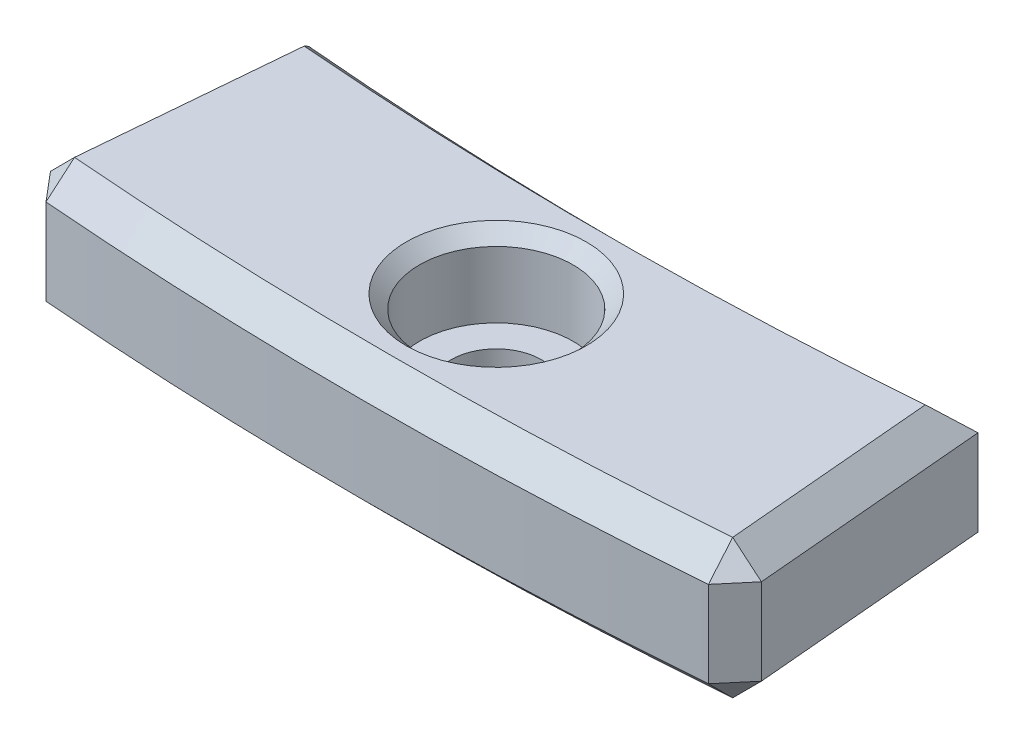
ISO-10303-21;
HEADER;
FILE_DESCRIPTION(('STEP AP214'),'2;1');
FILE_NAME('part.step','',(''),(''),'','','');
FILE_SCHEMA(('AUTOMOTIVE_DESIGN { 1 0 10303 214 1 1 1 1 }'));
ENDSEC;
DATA;
#1=APPLICATION_CONTEXT('core data for automotive mechanical design processes');
#2=APPLICATION_PROTOCOL_DEFINITION('international standard','automotive_design',2000,#1);
#3=PRODUCT_CONTEXT('',#1,'mechanical');
#4=PRODUCT('Part','Part','',(#3));
#5=PRODUCT_RELATED_PRODUCT_CATEGORY('part','',(#4));
#6=PRODUCT_DEFINITION_FORMATION('','',#4);
#7=PRODUCT_DEFINITION_CONTEXT('part definition',#1,'design');
#8=PRODUCT_DEFINITION('design','',#6,#7);
#9=PRODUCT_DEFINITION_SHAPE('','',#8);
#10=(LENGTH_UNIT() NAMED_UNIT(*) SI_UNIT(.MILLI.,.METRE.));
#11=(NAMED_UNIT(*) PLANE_ANGLE_UNIT() SI_UNIT($,.RADIAN.));
#12=(NAMED_UNIT(*) SI_UNIT($,.STERADIAN.) SOLID_ANGLE_UNIT());
#13=UNCERTAINTY_MEASURE_WITH_UNIT(LENGTH_MEASURE(1.E-05),#10,'distance_accuracy_value','');
#14=(GEOMETRIC_REPRESENTATION_CONTEXT(3) GLOBAL_UNCERTAINTY_ASSIGNED_CONTEXT((#13)) GLOBAL_UNIT_ASSIGNED_CONTEXT((#10,
#11,#12)) REPRESENTATION_CONTEXT('',''));
#15=CARTESIAN_POINT('',(0.,0.,0.));
#16=DIRECTION('',(0.,0.,1.));
#17=DIRECTION('',(1.,0.,0.));
#18=AXIS2_PLACEMENT_3D('',#15,#16,#17);
#19=CARTESIAN_POINT('',(0.,5.25,150.));
#20=DIRECTION('',(0.,-1.,0.));
#21=DIRECTION('',(0.,0.,-1.));
#22=AXIS2_PLACEMENT_3D('',#19,#20,#21);
#23=CYLINDRICAL_SURFACE('',#22,1.7);
#24=CARTESIAN_POINT('',(0.,0.,150.));
#25=DIRECTION('',(0.,1.,0.));
#26=DIRECTION('',(0.,0.,1.));
#27=AXIS2_PLACEMENT_3D('',#24,#25,#26);
#28=CIRCLE('',#27,1.7);
#29=CARTESIAN_POINT('',(0.,0.,148.3));
#30=VERTEX_POINT('',#29);
#31=EDGE_CURVE('E394',#30,#30,#28,.T.);
#32=CARTESIAN_POINT('',(0.,2.25,150.));
#33=DIRECTION('',(0.,1.,0.));
#34=DIRECTION('',(0.,0.,1.));
#35=AXIS2_PLACEMENT_3D('',#32,#33,#34);
#36=CIRCLE('',#35,1.7);
#37=CARTESIAN_POINT('',(0.,2.25,148.3));
#38=VERTEX_POINT('',#37);
#39=EDGE_CURVE('E391',#38,#38,#36,.T.);
#40=CARTESIAN_POINT('',(0.,0.,148.3));
#41=CARTESIAN_POINT('',(0.,0.0234375,148.3));
#42=CARTESIAN_POINT('',(0.,0.046875,148.3));
#43=CARTESIAN_POINT('',(0.,0.0937500000000001,148.3));
#44=CARTESIAN_POINT('',(0.,0.1171875,148.3));
#45=CARTESIAN_POINT('',(0.,0.1640625,148.3));
#46=CARTESIAN_POINT('',(0.,0.1875,148.3));
#47=CARTESIAN_POINT('',(0.,0.234375,148.3));
#48=CARTESIAN_POINT('',(0.,0.2578125,148.3));
#49=CARTESIAN_POINT('',(0.,0.3046875,148.3));
#50=CARTESIAN_POINT('',(0.,0.328125,148.3));
#51=CARTESIAN_POINT('',(0.,0.375,148.3));
#52=CARTESIAN_POINT('',(0.,0.3984375,148.3));
#53=CARTESIAN_POINT('',(0.,0.4453125,148.3));
#54=CARTESIAN_POINT('',(0.,0.46875,148.3));
#55=CARTESIAN_POINT('',(0.,0.515625,148.3));
#56=CARTESIAN_POINT('',(0.,0.5390625,148.3));
#57=CARTESIAN_POINT('',(0.,0.5859375,148.3));
#58=CARTESIAN_POINT('',(0.,0.609375,148.3));
#59=CARTESIAN_POINT('',(0.,0.65625,148.3));
#60=CARTESIAN_POINT('',(0.,0.6796875,148.3));
#61=CARTESIAN_POINT('',(0.,0.7265625,148.3));
#62=CARTESIAN_POINT('',(0.,0.75,148.3));
#63=CARTESIAN_POINT('',(0.,0.796875,148.3));
#64=CARTESIAN_POINT('',(0.,0.8203125,148.3));
#65=CARTESIAN_POINT('',(0.,0.8671875,148.3));
#66=CARTESIAN_POINT('',(0.,0.890625,148.3));
#67=CARTESIAN_POINT('',(0.,0.9375,148.3));
#68=CARTESIAN_POINT('',(0.,0.9609375,148.3));
#69=CARTESIAN_POINT('',(0.,1.0078125,148.3));
#70=CARTESIAN_POINT('',(0.,1.03125,148.3));
#71=CARTESIAN_POINT('',(0.,1.078125,148.3));
#72=CARTESIAN_POINT('',(0.,1.1015625,148.3));
#73=CARTESIAN_POINT('',(0.,1.1484375,148.3));
#74=CARTESIAN_POINT('',(0.,1.171875,148.3));
#75=CARTESIAN_POINT('',(0.,1.21875,148.3));
#76=CARTESIAN_POINT('',(0.,1.2421875,148.3));
#77=CARTESIAN_POINT('',(0.,1.2890625,148.3));
#78=CARTESIAN_POINT('',(0.,1.3125,148.3));
#79=CARTESIAN_POINT('',(0.,1.359375,148.3));
#80=CARTESIAN_POINT('',(0.,1.3828125,148.3));
#81=CARTESIAN_POINT('',(0.,1.4296875,148.3));
#82=CARTESIAN_POINT('',(0.,1.453125,148.3));
#83=CARTESIAN_POINT('',(0.,1.5,148.3));
#84=CARTESIAN_POINT('',(0.,1.5234375,148.3));
#85=CARTESIAN_POINT('',(0.,1.5703125,148.3));
#86=CARTESIAN_POINT('',(0.,1.59375,148.3));
#87=CARTESIAN_POINT('',(0.,1.640625,148.3));
#88=CARTESIAN_POINT('',(0.,1.6640625,148.3));
#89=CARTESIAN_POINT('',(0.,1.7109375,148.3));
#90=CARTESIAN_POINT('',(0.,1.734375,148.3));
#91=CARTESIAN_POINT('',(0.,1.78125,148.3));
#92=CARTESIAN_POINT('',(0.,1.8046875,148.3));
#93=CARTESIAN_POINT('',(0.,1.8515625,148.3));
#94=CARTESIAN_POINT('',(0.,1.875,148.3));
#95=CARTESIAN_POINT('',(0.,1.921875,148.3));
#96=CARTESIAN_POINT('',(0.,1.9453125,148.3));
#97=CARTESIAN_POINT('',(0.,1.9921875,148.3));
#98=CARTESIAN_POINT('',(0.,2.015625,148.3));
#99=CARTESIAN_POINT('',(0.,2.0625,148.3));
#100=CARTESIAN_POINT('',(0.,2.0859375,148.3));
#101=CARTESIAN_POINT('',(0.,2.1328125,148.3));
#102=CARTESIAN_POINT('',(0.,2.15625,148.3));
#103=CARTESIAN_POINT('',(0.,2.203125,148.3));
#104=CARTESIAN_POINT('',(0.,2.2265625,148.3));
#105=CARTESIAN_POINT('',(0.,2.25,148.3));
#106=B_SPLINE_CURVE_WITH_KNOTS('',3,(#40,#41,#42,#43,#44,#45,#46,#47,#48,#49,#50,#51,#52,#53,
#54,#55,#56,#57,#58,#59,#60,#61,#62,#63,#64,#65,#66,#67,#68,#69,#70,#71,#72,#73,#74,#75,#76,#77,
#78,#79,#80,#81,#82,#83,#84,#85,#86,#87,#88,#89,#90,#91,#92,#93,#94,#95,#96,#97,#98,#99,#100,
#101,#102,#103,#104,#105),.UNSPECIFIED.,.F.,.F.,(4,2,2,2,2,2,2,2,2,2,2,2,2,2,2,2,2,2,2,2,2,2,2,
2,2,2,2,2,2,2,2,2,4),(0.,0.0703125000000001,0.140625,0.2109375,0.28125,0.3515625,0.421875,
0.4921875,0.5625,0.6328125,0.703125,0.7734375,0.84375,0.9140625,0.984375,1.0546875,1.125,
1.1953125,1.265625,1.3359375,1.40625,1.4765625,1.546875,1.6171875,1.6875,1.7578125,1.828125,
1.8984375,1.96875,2.0390625,2.109375,2.1796875,2.25),.UNSPECIFIED.);
#107=EDGE_CURVE('BSEAM32',#30,#38,#106,.T.);
#108=ORIENTED_EDGE('',*,*,#31,.F.);
#109=ORIENTED_EDGE('',*,*,#39,.T.);
#110=ORIENTED_EDGE('',*,*,#107,.T.);
#111=ORIENTED_EDGE('',*,*,#107,.F.);
#112=EDGE_LOOP('',(#108,#110,#109,#111));
#113=FACE_BOUND('',#112,.T.);
#114=ADVANCED_FACE('F32',(#113),#23,.F.);
#115=CARTESIAN_POINT('',(0.,5.25,0.));
#116=DIRECTION('',(0.,1.,0.));
#117=DIRECTION('',(0.,0.,1.));
#118=AXIS2_PLACEMENT_3D('',#115,#116,#117);
#119=PLANE('',#118);
#120=DIRECTION('',(-0.0871557427476587,0.,0.996194698091746));
#121=VECTOR('',#120,1.);
#122=CARTESIAN_POINT('',(-12.5129454277953,5.25,154.497333946968));
#123=LINE('',#122,#121);
#124=CARTESIAN_POINT('',(-11.7282452609946,5.25,145.528169998451));
#125=VERTEX_POINT('',#124);
#126=CARTESIAN_POINT('',(-12.4255067088739,5.25,153.49790481641));
#127=VERTEX_POINT('',#126);
#128=EDGE_CURVE('E62',#125,#127,#123,.T.);
#129=ORIENTED_EDGE('',*,*,#128,.T.);
#130=CARTESIAN_POINT('',(0.,5.25,0.));
#131=DIRECTION('',(0.,1.,0.));
#132=DIRECTION('',(0.,0.,1.));
#133=AXIS2_PLACEMENT_3D('',#130,#131,#132);
#134=CIRCLE('',#133,154.);
#135=CARTESIAN_POINT('',(12.4255067088739,5.25,153.49790481641));
#136=VERTEX_POINT('',#135);
#137=EDGE_CURVE('E11',#127,#136,#134,.T.);
#138=ORIENTED_EDGE('',*,*,#137,.T.);
#139=DIRECTION('',(-0.0871557427476587,0.,-0.996194698091746));
#140=VECTOR('',#139,1.);
#141=CARTESIAN_POINT('',(11.6413880003187,5.25,144.535386966051));
#142=LINE('',#141,#140);
#143=CARTESIAN_POINT('',(11.7282452609946,5.25,145.528169998451));
#144=VERTEX_POINT('',#143);
#145=EDGE_CURVE('E47',#136,#144,#142,.T.);
#146=ORIENTED_EDGE('',*,*,#145,.T.);
#147=CARTESIAN_POINT('',(0.,5.25,0.));
#148=DIRECTION('',(0.,1.,0.));
#149=DIRECTION('',(0.,0.,1.));
#150=AXIS2_PLACEMENT_3D('',#147,#148,#149);
#151=CIRCLE('',#150,146.);
#152=EDGE_CURVE('E430',#144,#125,#151,.F.);
#153=ORIENTED_EDGE('',*,*,#152,.T.);
#154=EDGE_LOOP('',(#129,#138,#146,#153));
#155=FACE_BOUND('',#154,.T.);
#156=CARTESIAN_POINT('',(0.,5.25,150.));
#157=DIRECTION('',(0.,1.,0.));
#158=DIRECTION('',(0.,0.,1.));
#159=AXIS2_PLACEMENT_3D('',#156,#157,#158);
#160=CIRCLE('',#159,3.40000000000001);
#161=CARTESIAN_POINT('',(0.,5.25,153.4));
#162=VERTEX_POINT('',#161);
#163=EDGE_CURVE('E130',#162,#162,#160,.F.);
#164=ORIENTED_EDGE('',*,*,#163,.T.);
#165=EDGE_LOOP('',(#164));
#166=FACE_BOUND('',#165,.T.);
#167=ADVANCED_FACE('F178',(#155,#166),#119,.T.);
#168=CARTESIAN_POINT('',(0.,0.,0.));
#169=DIRECTION('',(0.,1.,0.));
#170=DIRECTION('',(0.,0.,1.));
#171=AXIS2_PLACEMENT_3D('',#168,#169,#170);
#172=PLANE('',#171);
#173=CARTESIAN_POINT('',(0.,0.,0.));
#174=DIRECTION('',(0.,1.,0.));
#175=DIRECTION('',(0.,0.,1.));
#176=AXIS2_PLACEMENT_3D('',#173,#174,#175);
#177=CIRCLE('',#176,154.);
#178=CARTESIAN_POINT('',(12.4255067088739,0.,153.49790481641));
#179=VERTEX_POINT('',#178);
#180=CARTESIAN_POINT('',(-12.4255067088739,0.,153.49790481641));
#181=VERTEX_POINT('',#180);
#182=EDGE_CURVE('E410',#179,#181,#177,.F.);
#183=ORIENTED_EDGE('',*,*,#182,.T.);
#184=DIRECTION('',(0.0871557427476587,0.,-0.996194698091746));
#185=VECTOR('',#184,1.);
#186=CARTESIAN_POINT('',(0.996194698091842,0.,0.0871557427476671));
#187=LINE('',#186,#185);
#188=CARTESIAN_POINT('',(-11.6410874597011,0.,144.531951771072));
#189=VERTEX_POINT('',#188);
#190=EDGE_CURVE('E152',#181,#189,#187,.T.);
#191=ORIENTED_EDGE('',*,*,#190,.T.);
#192=CARTESIAN_POINT('',(0.,0.,0.));
#193=DIRECTION('',(0.,-1.,0.));
#194=DIRECTION('',(0.,0.,1.));
#195=AXIS2_PLACEMENT_3D('',#192,#193,#194);
#196=CIRCLE('',#195,145.);
#197=CARTESIAN_POINT('',(11.6410874597011,0.,144.531951771072));
#198=VERTEX_POINT('',#197);
#199=EDGE_CURVE('E399',#198,#189,#196,.T.);
#200=ORIENTED_EDGE('',*,*,#199,.F.);
#201=DIRECTION('',(0.0871557427476587,0.,0.996194698091746));
#202=VECTOR('',#201,1.);
#203=CARTESIAN_POINT('',(-0.996194698091842,0.,0.0871557427476671));
#204=LINE('',#203,#202);
#205=EDGE_CURVE('E408',#198,#179,#204,.T.);
#206=ORIENTED_EDGE('',*,*,#205,.T.);
#207=EDGE_LOOP('',(#183,#191,#200,#206));
#208=FACE_BOUND('',#207,.T.);
#209=ORIENTED_EDGE('',*,*,#31,.T.);
#210=EDGE_LOOP('',(#209));
#211=FACE_BOUND('',#210,.T.);
#212=ADVANCED_FACE('F184',(#208,#211),#172,.F.);
#213=CARTESIAN_POINT('',(0.,5.25,0.));
#214=DIRECTION('',(0.,-1.,0.));
#215=DIRECTION('',(0.,0.,-1.));
#216=AXIS2_PLACEMENT_3D('',#213,#214,#215);
#217=CYLINDRICAL_SURFACE('',#216,145.);
#218=ORIENTED_EDGE('',*,*,#199,.T.);
#219=CARTESIAN_POINT('',(0.,1.00000000000007,0.));
#220=DIRECTION('',(0.704416026402749,0.707106781186557,0.0616284167162189));
#221=DIRECTION('',(0.704416026402768,-0.707106781186538,0.0616284167162206));
#222=AXIS2_PLACEMENT_3D('',#219,#220,#221);
#223=ELLIPSE('',#222,205.060966544096,145.);
#224=CARTESIAN_POINT('',(-12.6375826984104,1.,144.448231223303));
#225=VERTEX_POINT('',#224);
#226=EDGE_CURVE('E140',#189,#225,#223,.F.);
#227=ORIENTED_EDGE('',*,*,#226,.T.);
#228=DIRECTION('',(0.,-1.,0.));
#229=VECTOR('',#228,1.);
#230=CARTESIAN_POINT('',(-12.6375826984104,5.25,144.448231223303));
#231=LINE('',#230,#229);
#232=CARTESIAN_POINT('',(-12.6375826984104,4.24999999999998,144.448231223303));
#233=VERTEX_POINT('',#232);
#234=EDGE_CURVE('E122',#233,#225,#231,.T.);
#235=ORIENTED_EDGE('',*,*,#234,.F.);
#236=CARTESIAN_POINT('',(0.,4.24999999999998,0.));
#237=DIRECTION('',(0.,1.,0.));
#238=DIRECTION('',(0.,0.,1.));
#239=AXIS2_PLACEMENT_3D('',#236,#237,#238);
#240=CIRCLE('',#239,145.);
#241=CARTESIAN_POINT('',(12.6375826984104,4.24999999999998,144.448231223303));
#242=VERTEX_POINT('',#241);
#243=EDGE_CURVE('E137',#233,#242,#240,.T.);
#244=ORIENTED_EDGE('',*,*,#243,.T.);
#245=DIRECTION('',(0.,-1.,0.));
#246=VECTOR('',#245,1.);
#247=CARTESIAN_POINT('',(12.6375826984104,5.25,144.448231223303));
#248=LINE('',#247,#246);
#249=CARTESIAN_POINT('',(12.6375826984104,1.,144.448231223303));
#250=VERTEX_POINT('',#249);
#251=EDGE_CURVE('E142',#242,#250,#248,.T.);
#252=ORIENTED_EDGE('',*,*,#251,.T.);
#253=CARTESIAN_POINT('',(0.,1.00000000000007,0.));
#254=DIRECTION('',(-0.704416026402749,0.707106781186557,0.0616284167162189));
#255=DIRECTION('',(-0.704416026402768,-0.707106781186538,0.0616284167162206));
#256=AXIS2_PLACEMENT_3D('',#253,#254,#255);
#257=ELLIPSE('',#256,205.060966544096,145.);
#258=EDGE_CURVE('E151',#250,#198,#257,.F.);
#259=ORIENTED_EDGE('',*,*,#258,.T.);
#260=EDGE_LOOP('',(#218,#227,#235,#244,#252,#259));
#261=FACE_BOUND('',#260,.T.);
#262=ADVANCED_FACE('F135',(#261),#217,.F.);
#263=CARTESIAN_POINT('',(-13.509140125887,5.25,154.410178204221));
#264=DIRECTION('',(0.996194698091746,0.,0.0871557427476587));
#265=DIRECTION('',(0.0871557427476587,0.,-0.996194698091745));
#266=AXIS2_PLACEMENT_3D('',#263,#264,#265);
#267=PLANE('',#266);
#268=ORIENTED_EDGE('',*,*,#234,.T.);
#269=DIRECTION('',(-0.0871557427476587,0.,0.996194698091745));
#270=VECTOR('',#269,1.);
#271=CARTESIAN_POINT('',(-13.509140125887,1.,154.410178204221));
#272=LINE('',#271,#270);
#273=CARTESIAN_POINT('',(-13.4217014069656,1.,153.410749073663));
#274=VERTEX_POINT('',#273);
#275=EDGE_CURVE('E406',#225,#274,#272,.T.);
#276=ORIENTED_EDGE('',*,*,#275,.T.);
#277=DIRECTION('',(0.,1.,0.));
#278=VECTOR('',#277,1.);
#279=CARTESIAN_POINT('',(-13.4217014069656,5.25,153.410749073663));
#280=LINE('',#279,#278);
#281=CARTESIAN_POINT('',(-13.4217014069656,4.24999999999998,153.410749073663));
#282=VERTEX_POINT('',#281);
#283=EDGE_CURVE('E125',#274,#282,#280,.T.);
#284=ORIENTED_EDGE('',*,*,#283,.T.);
#285=DIRECTION('',(0.0871557427476587,0.,-0.996194698091745));
#286=VECTOR('',#285,1.);
#287=CARTESIAN_POINT('',(-12.6375826984104,4.24999999999998,144.448231223303));
#288=LINE('',#287,#286);
#289=EDGE_CURVE('E118',#282,#233,#288,.T.);
#290=ORIENTED_EDGE('',*,*,#289,.T.);
#291=EDGE_LOOP('',(#268,#276,#284,#290));
#292=FACE_BOUND('',#291,.T.);
#293=ADVANCED_FACE('F120',(#292),#267,.F.);
#294=CARTESIAN_POINT('',(0.,5.25,0.));
#295=DIRECTION('',(0.,-1.,0.));
#296=DIRECTION('',(0.,0.,-1.));
#297=AXIS2_PLACEMENT_3D('',#294,#295,#296);
#298=CYLINDRICAL_SURFACE('',#297,155.);
#299=DIRECTION('',(0.,-1.,0.));
#300=VECTOR('',#299,1.);
#301=CARTESIAN_POINT('',(-12.5061918173731,5.25,154.494644458075));
#302=LINE('',#301,#300);
#303=CARTESIAN_POINT('',(-12.5061918173731,4.24999999999998,154.494644458075));
#304=VERTEX_POINT('',#303);
#305=CARTESIAN_POINT('',(-12.5061918173731,1.,154.494644458075));
#306=VERTEX_POINT('',#305);
#307=EDGE_CURVE('E417',#304,#306,#302,.T.);
#308=ORIENTED_EDGE('',*,*,#307,.T.);
#309=CARTESIAN_POINT('',(0.,1.,0.));
#310=DIRECTION('',(0.,1.,0.));
#311=DIRECTION('',(0.,0.,1.));
#312=AXIS2_PLACEMENT_3D('',#309,#310,#311);
#313=CIRCLE('',#312,155.);
#314=CARTESIAN_POINT('',(12.506191817373,1.,154.494644458075));
#315=VERTEX_POINT('',#314);
#316=EDGE_CURVE('E421',#306,#315,#313,.T.);
#317=ORIENTED_EDGE('',*,*,#316,.T.);
#318=DIRECTION('',(0.,-1.,0.));
#319=VECTOR('',#318,1.);
#320=CARTESIAN_POINT('',(12.506191817373,5.25,154.494644458075));
#321=LINE('',#320,#319);
#322=CARTESIAN_POINT('',(12.506191817373,4.24999999999998,154.494644458075));
#323=VERTEX_POINT('',#322);
#324=EDGE_CURVE('E419',#315,#323,#321,.F.);
#325=ORIENTED_EDGE('',*,*,#324,.T.);
#326=CARTESIAN_POINT('',(0.,4.24999999999998,0.));
#327=DIRECTION('',(0.,1.,0.));
#328=DIRECTION('',(0.,0.,1.));
#329=AXIS2_PLACEMENT_3D('',#326,#327,#328);
#330=CIRCLE('',#329,155.);
#331=EDGE_CURVE('E415',#323,#304,#330,.F.);
#332=ORIENTED_EDGE('',*,*,#331,.T.);
#333=EDGE_LOOP('',(#308,#317,#325,#332));
#334=FACE_BOUND('',#333,.T.);
#335=ADVANCED_FACE('F198',(#334),#298,.T.);
#336=CARTESIAN_POINT('',(13.509140125887,5.25,154.410178204221));
#337=DIRECTION('',(-0.996194698091746,0.,0.0871557427476587));
#338=DIRECTION('',(0.0871557427476587,0.,0.996194698091745));
#339=AXIS2_PLACEMENT_3D('',#336,#337,#338);
#340=PLANE('',#339);
#341=DIRECTION('',(0.,-1.,0.));
#342=VECTOR('',#341,1.);
#343=CARTESIAN_POINT('',(13.4217014069656,5.25,153.410749073663));
#344=LINE('',#343,#342);
#345=CARTESIAN_POINT('',(13.4217014069656,4.24999999999998,153.410749073663));
#346=VERTEX_POINT('',#345);
#347=CARTESIAN_POINT('',(13.4217014069656,1.,153.410749073663));
#348=VERTEX_POINT('',#347);
#349=EDGE_CURVE('E426',#346,#348,#344,.T.);
#350=ORIENTED_EDGE('',*,*,#349,.T.);
#351=DIRECTION('',(-0.0871557427476587,0.,-0.996194698091745));
#352=VECTOR('',#351,1.);
#353=CARTESIAN_POINT('',(13.509140125887,1.,154.410178204221));
#354=LINE('',#353,#352);
#355=EDGE_CURVE('E428',#348,#250,#354,.T.);
#356=ORIENTED_EDGE('',*,*,#355,.T.);
#357=ORIENTED_EDGE('',*,*,#251,.F.);
#358=DIRECTION('',(0.0871557427476587,0.,0.996194698091745));
#359=VECTOR('',#358,1.);
#360=CARTESIAN_POINT('',(13.509140125887,4.24999999999998,154.410178204221));
#361=LINE('',#360,#359);
#362=EDGE_CURVE('E424',#242,#346,#361,.T.);
#363=ORIENTED_EDGE('',*,*,#362,.T.);
#364=EDGE_LOOP('',(#350,#356,#357,#363));
#365=FACE_BOUND('',#364,.T.);
#366=ADVANCED_FACE('F195',(#365),#340,.F.);
#367=CARTESIAN_POINT('',(0.,2.25,150.));
#368=DIRECTION('',(0.,1.,0.));
#369=DIRECTION('',(0.,0.,1.));
#370=AXIS2_PLACEMENT_3D('',#367,#368,#369);
#371=CYLINDRICAL_SURFACE('',#370,2.9);
#372=CARTESIAN_POINT('',(0.,4.74999999999998,150.));
#373=DIRECTION('',(0.,1.,0.));
#374=DIRECTION('',(0.,0.,1.));
#375=AXIS2_PLACEMENT_3D('',#372,#373,#374);
#376=CIRCLE('',#375,2.9);
#377=CARTESIAN_POINT('',(0.,4.74999999999998,152.9));
#378=VERTEX_POINT('',#377);
#379=EDGE_CURVE('E141',#378,#378,#376,.T.);
#380=ORIENTED_EDGE('',*,*,#379,.T.);
#381=EDGE_LOOP('',(#380));
#382=FACE_BOUND('',#381,.T.);
#383=CARTESIAN_POINT('',(0.,2.25,150.));
#384=DIRECTION('',(0.,1.,0.));
#385=DIRECTION('',(0.,0.,1.));
#386=AXIS2_PLACEMENT_3D('',#383,#384,#385);
#387=CIRCLE('',#386,2.9);
#388=CARTESIAN_POINT('',(0.,2.25,152.9));
#389=VERTEX_POINT('',#388);
#390=EDGE_CURVE('E389',#389,#389,#387,.T.);
#391=ORIENTED_EDGE('',*,*,#390,.F.);
#392=EDGE_LOOP('',(#391));
#393=FACE_BOUND('',#392,.T.);
#394=ADVANCED_FACE('F189',(#382,#393),#371,.F.);
#395=CARTESIAN_POINT('',(0.,2.25,150.));
#396=DIRECTION('',(0.,1.,0.));
#397=DIRECTION('',(0.,0.,1.));
#398=AXIS2_PLACEMENT_3D('',#395,#396,#397);
#399=PLANE('',#398);
#400=ORIENTED_EDGE('',*,*,#39,.F.);
#401=EDGE_LOOP('',(#400));
#402=FACE_BOUND('',#401,.T.);
#403=ORIENTED_EDGE('',*,*,#390,.T.);
#404=EDGE_LOOP('',(#403));
#405=FACE_BOUND('',#404,.T.);
#406=ADVANCED_FACE('F210',(#402,#405),#399,.T.);
#407=CARTESIAN_POINT('',(0.,4.74999999999998,150.));
#408=DIRECTION('',(0.,1.,0.));
#409=DIRECTION('',(0.,0.,1.));
#410=AXIS2_PLACEMENT_3D('',#407,#408,#409);
#411=CONICAL_SURFACE('',#410,2.9,0.785398163397442);
#412=ORIENTED_EDGE('',*,*,#163,.F.);
#413=EDGE_LOOP('',(#412));
#414=FACE_BOUND('',#413,.T.);
#415=ORIENTED_EDGE('',*,*,#379,.F.);
#416=EDGE_LOOP('',(#415));
#417=FACE_BOUND('',#416,.T.);
#418=ADVANCED_FACE('F207',(#414,#417),#411,.F.);
#419=CARTESIAN_POINT('',(-0.996194698091812,5.25,0.0871557427476645));
#420=DIRECTION('',(0.704416026402768,0.707106781186538,-0.0616284167162205));
#421=DIRECTION('',(0.0871557427476587,0.,0.996194698091745));
#422=AXIS2_PLACEMENT_3D('',#419,#420,#421);
#423=PLANE('',#422);
#424=DIRECTION('',(-0.704416026402749,0.707106781186557,0.0616284167162284));
#425=VECTOR('',#424,1.);
#426=CARTESIAN_POINT('',(12.9203696595493,4.75324675324675,153.454609918227));
#427=LINE('',#426,#425);
#428=EDGE_CURVE('E155',#346,#136,#427,.T.);
#429=ORIENTED_EDGE('',*,*,#428,.F.);
#430=ORIENTED_EDGE('',*,*,#362,.F.);
#431=CARTESIAN_POINT('',(11.7282452609946,5.25,145.528169998451));
#432=CARTESIAN_POINT('',(11.8800232976214,5.08314394218366,145.348542334818));
#433=CARTESIAN_POINT('',(12.0316904355504,4.91638258012811,145.168733605274));
#434=CARTESIAN_POINT('',(12.33480291469,4.58304924679393,144.80875401356));
#435=CARTESIAN_POINT('',(12.4862482558996,4.41647727551613,144.628583151388));
#436=CARTESIAN_POINT('',(12.6375826984104,4.24999999999997,144.448231223303));
#437=B_SPLINE_CURVE_WITH_KNOTS('',3,(#431,#432,#433,#434,#435,#436),.UNSPECIFIED.,.F.,.F.,(4,2,
4),(0.,0.865038187828161,1.73007637952131),.UNSPECIFIED.);
#438=EDGE_CURVE('E37',#144,#242,#437,.T.);
#439=ORIENTED_EDGE('',*,*,#438,.F.);
#440=ORIENTED_EDGE('',*,*,#145,.F.);
#441=EDGE_LOOP('',(#429,#430,#439,#440));
#442=FACE_BOUND('',#441,.T.);
#443=ADVANCED_FACE('F34',(#442),#423,.T.);
#444=CARTESIAN_POINT('',(0.,5.25,0.));
#445=DIRECTION('',(0.,1.,0.));
#446=DIRECTION('',(0.,0.,1.));
#447=AXIS2_PLACEMENT_3D('',#444,#445,#446);
#448=CONICAL_SURFACE('',#447,146.,0.785398163397436);
#449=ORIENTED_EDGE('',*,*,#438,.T.);
#450=ORIENTED_EDGE('',*,*,#243,.F.);
#451=CARTESIAN_POINT('',(-12.6375826984104,4.24999999999998,144.448231223303));
#452=CARTESIAN_POINT('',(-12.4862482558996,4.41647727551614,144.628583151388));
#453=CARTESIAN_POINT('',(-12.33480291469,4.58304924679393,144.80875401356));
#454=CARTESIAN_POINT('',(-12.0316904355504,4.91638258012812,145.168733605274));
#455=CARTESIAN_POINT('',(-11.8800232976214,5.08314394218367,145.348542334818));
#456=CARTESIAN_POINT('',(-11.7282452609946,5.25,145.528169998451));
#457=B_SPLINE_CURVE_WITH_KNOTS('',3,(#451,#452,#453,#454,#455,#456),.UNSPECIFIED.,.F.,.F.,(4,2,
4),(0.,0.865038191693143,1.7300763795213),.UNSPECIFIED.);
#458=EDGE_CURVE('E149',#125,#233,#457,.F.);
#459=ORIENTED_EDGE('',*,*,#458,.F.);
#460=ORIENTED_EDGE('',*,*,#152,.F.);
#461=EDGE_LOOP('',(#449,#450,#459,#460));
#462=FACE_BOUND('',#461,.T.);
#463=ADVANCED_FACE('F147',(#462),#448,.F.);
#464=CARTESIAN_POINT('',(12.506191817373,4.24999999999998,154.494644458075));
#465=DIRECTION('',(0.624441525424568,0.576096521197049,0.527433009575716));
#466=DIRECTION('',(-0.678082405415791,0.734985885215176,0.));
#467=AXIS2_PLACEMENT_3D('',#464,#465,#466);
#468=PLANE('',#467);
#469=DIRECTION('',(-0.645271392091265,0.,0.763953421714047));
#470=VECTOR('',#469,1.);
#471=CARTESIAN_POINT('',(12.506191817373,4.24999999999997,154.494644458075));
#472=LINE('',#471,#470);
#473=EDGE_CURVE('E157',#346,#323,#472,.T.);
#474=ORIENTED_EDGE('',*,*,#473,.F.);
#475=ORIENTED_EDGE('',*,*,#428,.T.);
#476=DIRECTION('',(0.0570529873605373,-0.707106781186556,0.704801359698764));
#477=VECTOR('',#476,1.);
#478=CARTESIAN_POINT('',(4.24627482423276E-13,159.250000000004,3.58660566096709E-13));
#479=LINE('',#478,#477);
#480=EDGE_CURVE('E55',#323,#136,#479,.F.);
#481=ORIENTED_EDGE('',*,*,#480,.F.);
#482=EDGE_LOOP('',(#474,#475,#481));
#483=FACE_BOUND('',#482,.T.);
#484=ADVANCED_FACE('F170',(#483),#468,.T.);
#485=CARTESIAN_POINT('',(0.996194698091812,5.25,0.0871557427476645));
#486=DIRECTION('',(-0.704416026402768,0.707106781186538,-0.0616284167162205));
#487=DIRECTION('',(0.0871557427476587,0.,-0.996194698091745));
#488=AXIS2_PLACEMENT_3D('',#485,#486,#487);
#489=PLANE('',#488);
#490=ORIENTED_EDGE('',*,*,#458,.T.);
#491=ORIENTED_EDGE('',*,*,#289,.F.);
#492=DIRECTION('',(-0.704416026402749,-0.707106781186557,-0.0616284167162302));
#493=VECTOR('',#492,1.);
#494=CARTESIAN_POINT('',(-13.4217014069656,4.24999999999998,153.410749073663));
#495=LINE('',#494,#493);
#496=EDGE_CURVE('E456',#127,#282,#495,.T.);
#497=ORIENTED_EDGE('',*,*,#496,.F.);
#498=ORIENTED_EDGE('',*,*,#128,.F.);
#499=EDGE_LOOP('',(#490,#491,#497,#498));
#500=FACE_BOUND('',#499,.T.);
#501=ADVANCED_FACE('F154',(#500),#489,.T.);
#502=CARTESIAN_POINT('',(0.,5.25,0.));
#503=DIRECTION('',(0.,-1.,0.));
#504=DIRECTION('',(0.,0.,-1.));
#505=AXIS2_PLACEMENT_3D('',#502,#503,#504);
#506=CONICAL_SURFACE('',#505,154.,0.785398163397436);
#507=ORIENTED_EDGE('',*,*,#480,.T.);
#508=ORIENTED_EDGE('',*,*,#137,.F.);
#509=DIRECTION('',(0.0570529873605543,0.707106781186556,-0.704801359698762));
#510=VECTOR('',#509,1.);
#511=CARTESIAN_POINT('',(9.27247767740631E-13,159.250000000003,-7.83197562700961E-13));
#512=LINE('',#511,#510);
#513=EDGE_CURVE('E453',#304,#127,#512,.T.);
#514=ORIENTED_EDGE('',*,*,#513,.F.);
#515=ORIENTED_EDGE('',*,*,#331,.F.);
#516=EDGE_LOOP('',(#507,#508,#514,#515));
#517=FACE_BOUND('',#516,.T.);
#518=ADVANCED_FACE('F169',(#517),#506,.T.);
#519=CARTESIAN_POINT('',(13.4217014069656,5.25,153.410749073663));
#520=DIRECTION('',(-0.763953421714047,0.,-0.645271392091265));
#521=DIRECTION('',(0.,-1.,0.));
#522=AXIS2_PLACEMENT_3D('',#519,#520,#521);
#523=PLANE('',#522);
#524=ORIENTED_EDGE('',*,*,#473,.T.);
#525=ORIENTED_EDGE('',*,*,#324,.F.);
#526=DIRECTION('',(0.645271392091265,0.,-0.763953421714047));
#527=VECTOR('',#526,1.);
#528=CARTESIAN_POINT('',(12.506191817373,1.,154.494644458075));
#529=LINE('',#528,#527);
#530=EDGE_CURVE('E450',#348,#315,#529,.F.);
#531=ORIENTED_EDGE('',*,*,#530,.F.);
#532=ORIENTED_EDGE('',*,*,#349,.F.);
#533=EDGE_LOOP('',(#524,#525,#531,#532));
#534=FACE_BOUND('',#533,.T.);
#535=ADVANCED_FACE('F239',(#534),#523,.F.);
#536=CARTESIAN_POINT('',(13.509140125887,1.,154.410178204221));
#537=DIRECTION('',(-0.704416026402749,0.707106781186557,0.0616284167162189));
#538=DIRECTION('',(-0.0871557427476587,0.,-0.996194698091745));
#539=AXIS2_PLACEMENT_3D('',#536,#537,#538);
#540=PLANE('',#539);
#541=ORIENTED_EDGE('',*,*,#258,.F.);
#542=ORIENTED_EDGE('',*,*,#355,.F.);
#543=DIRECTION('',(-0.704416026402769,-0.707106781186538,0.0616284167162099));
#544=VECTOR('',#543,1.);
#545=CARTESIAN_POINT('',(12.9203696595493,0.496753246753242,153.454609918227));
#546=LINE('',#545,#544);
#547=EDGE_CURVE('E447',#179,#348,#546,.F.);
#548=ORIENTED_EDGE('',*,*,#547,.F.);
#549=ORIENTED_EDGE('',*,*,#205,.F.);
#550=EDGE_LOOP('',(#541,#542,#548,#549));
#551=FACE_BOUND('',#550,.T.);
#552=ADVANCED_FACE('F235',(#551),#540,.F.);
#553=CARTESIAN_POINT('',(-13.4217014069656,4.24999999999998,153.410749073663));
#554=DIRECTION('',(-0.624441525424573,0.576096521197053,0.527433009575705));
#555=DIRECTION('',(-0.67808240541579,-0.734985885215176,0.));
#556=AXIS2_PLACEMENT_3D('',#553,#554,#555);
#557=PLANE('',#556);
#558=ORIENTED_EDGE('',*,*,#513,.T.);
#559=ORIENTED_EDGE('',*,*,#496,.T.);
#560=DIRECTION('',(-0.645271392091255,0.,-0.763953421714056));
#561=VECTOR('',#560,1.);
#562=CARTESIAN_POINT('',(-13.4217014069656,4.24999999999998,153.410749073663));
#563=LINE('',#562,#561);
#564=EDGE_CURVE('E444',#304,#282,#563,.T.);
#565=ORIENTED_EDGE('',*,*,#564,.F.);
#566=EDGE_LOOP('',(#558,#559,#565));
#567=FACE_BOUND('',#566,.T.);
#568=ADVANCED_FACE('F231',(#567),#557,.T.);
#569=CARTESIAN_POINT('',(12.506191817373,1.,154.494644458075));
#570=DIRECTION('',(0.624441525424551,-0.57609652119708,0.527433009575701));
#571=DIRECTION('',(0.67808240541582,0.734985885215148,0.));
#572=AXIS2_PLACEMENT_3D('',#569,#570,#571);
#573=PLANE('',#572);
#574=ORIENTED_EDGE('',*,*,#547,.T.);
#575=ORIENTED_EDGE('',*,*,#530,.T.);
#576=DIRECTION('',(-0.0570529873605592,-0.707106781186538,-0.70480135969878));
#577=VECTOR('',#576,1.);
#578=CARTESIAN_POINT('',(-1.23055311232865E-12,-153.999999999995,-1.03938368134145E-12));
#579=LINE('',#578,#577);
#580=EDGE_CURVE('E442',#179,#315,#579,.F.);
#581=ORIENTED_EDGE('',*,*,#580,.F.);
#582=EDGE_LOOP('',(#574,#575,#581));
#583=FACE_BOUND('',#582,.T.);
#584=ADVANCED_FACE('F227',(#583),#573,.T.);
#585=CARTESIAN_POINT('',(-12.5061918173731,5.25,154.494644458075));
#586=DIRECTION('',(0.763953421714056,0.,-0.645271392091255));
#587=DIRECTION('',(0.,-1.,0.));
#588=AXIS2_PLACEMENT_3D('',#585,#586,#587);
#589=PLANE('',#588);
#590=ORIENTED_EDGE('',*,*,#564,.T.);
#591=ORIENTED_EDGE('',*,*,#283,.F.);
#592=DIRECTION('',(0.645271392091255,0.,0.763953421714056));
#593=VECTOR('',#592,1.);
#594=CARTESIAN_POINT('',(-13.4217014069656,0.999999999999999,153.410749073663));
#595=LINE('',#594,#593);
#596=EDGE_CURVE('E439',#306,#274,#595,.F.);
#597=ORIENTED_EDGE('',*,*,#596,.F.);
#598=ORIENTED_EDGE('',*,*,#307,.F.);
#599=EDGE_LOOP('',(#590,#591,#597,#598));
#600=FACE_BOUND('',#599,.T.);
#601=ADVANCED_FACE('F223',(#600),#589,.F.);
#602=CARTESIAN_POINT('',(0.,1.,0.));
#603=DIRECTION('',(0.,1.,0.));
#604=DIRECTION('',(0.,0.,1.));
#605=AXIS2_PLACEMENT_3D('',#602,#603,#604);
#606=CONICAL_SURFACE('',#605,155.,0.785398163397462);
#607=ORIENTED_EDGE('',*,*,#580,.T.);
#608=ORIENTED_EDGE('',*,*,#316,.F.);
#609=DIRECTION('',(-0.0570529873605779,0.707106781186538,0.704801359698779));
#610=VECTOR('',#609,1.);
#611=CARTESIAN_POINT('',(2.68641876635129E-12,-153.999999999993,-2.26907705081581E-12));
#612=LINE('',#611,#610);
#613=EDGE_CURVE('E436',#181,#306,#612,.T.);
#614=ORIENTED_EDGE('',*,*,#613,.F.);
#615=ORIENTED_EDGE('',*,*,#182,.F.);
#616=EDGE_LOOP('',(#607,#608,#614,#615));
#617=FACE_BOUND('',#616,.T.);
#618=ADVANCED_FACE('F219',(#617),#606,.T.);
#619=CARTESIAN_POINT('',(-13.4217014069656,1.,153.410749073663));
#620=DIRECTION('',(-0.624441525424555,-0.576096521197085,0.527433009575691));
#621=DIRECTION('',(0.678082405415821,-0.734985885215148,0.));
#622=AXIS2_PLACEMENT_3D('',#619,#620,#621);
#623=PLANE('',#622);
#624=ORIENTED_EDGE('',*,*,#613,.T.);
#625=ORIENTED_EDGE('',*,*,#596,.T.);
#626=DIRECTION('',(-0.704416026402769,0.707106781186538,-0.0616284167162099));
#627=VECTOR('',#626,1.);
#628=CARTESIAN_POINT('',(-13.4217014069656,1.,153.410749073663));
#629=LINE('',#628,#627);
#630=EDGE_CURVE('E434',#181,#274,#629,.T.);
#631=ORIENTED_EDGE('',*,*,#630,.F.);
#632=EDGE_LOOP('',(#624,#625,#631));
#633=FACE_BOUND('',#632,.T.);
#634=ADVANCED_FACE('F215',(#633),#623,.T.);
#635=CARTESIAN_POINT('',(-13.509140125887,1.,154.410178204221));
#636=DIRECTION('',(0.704416026402749,0.707106781186557,0.0616284167162189));
#637=DIRECTION('',(-0.0871557427476587,0.,0.996194698091745));
#638=AXIS2_PLACEMENT_3D('',#635,#636,#637);
#639=PLANE('',#638);
#640=ORIENTED_EDGE('',*,*,#226,.F.);
#641=ORIENTED_EDGE('',*,*,#190,.F.);
#642=ORIENTED_EDGE('',*,*,#630,.T.);
#643=ORIENTED_EDGE('',*,*,#275,.F.);
#644=EDGE_LOOP('',(#640,#641,#642,#643));
#645=FACE_BOUND('',#644,.T.);
#646=ADVANCED_FACE('F212',(#645),#639,.F.);
#647=CLOSED_SHELL('',(#114,#167,#212,#262,#293,#335,#366,#394,#406,#418,#443,#463,#484,#501,
#518,#535,#552,#568,#584,#601,#618,#634,#646));
#648=MANIFOLD_SOLID_BREP('B2',#647);
#649=ADVANCED_BREP_SHAPE_REPRESENTATION('',(#18,#648),#14);
#650=SHAPE_DEFINITION_REPRESENTATION(#9,#649);
ENDSEC;
END-ISO-10303-21;
